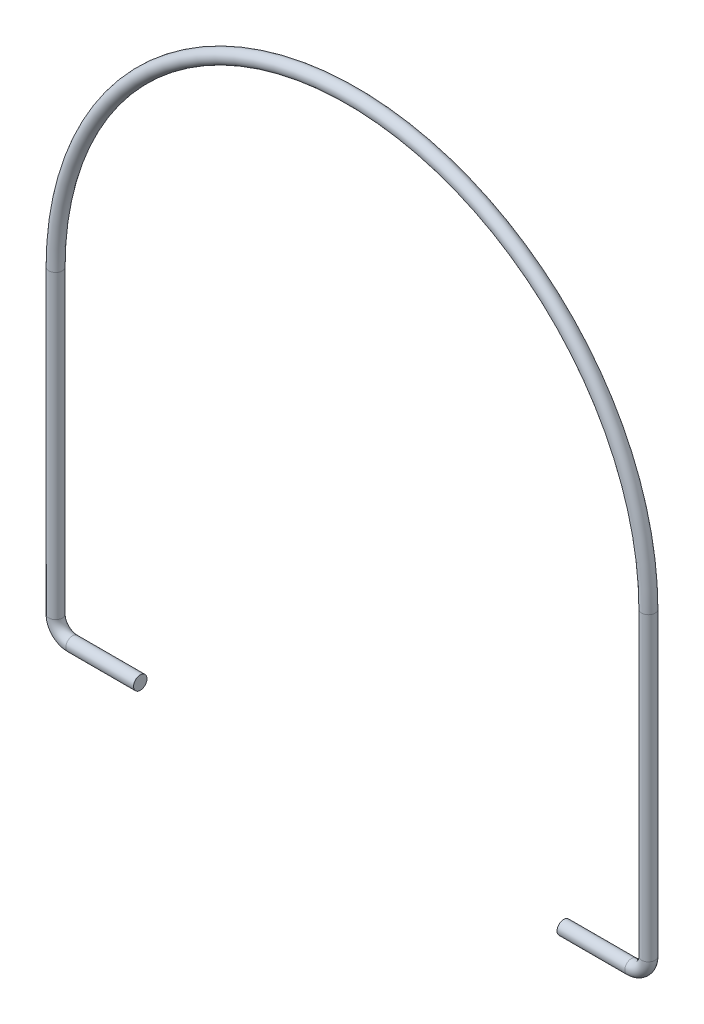
ISO-10303-21;
HEADER;
FILE_DESCRIPTION(('STEP AP214'),'2;1');
FILE_NAME('part.step','',(''),(''),'','','');
FILE_SCHEMA(('AUTOMOTIVE_DESIGN { 1 0 10303 214 1 1 1 1 }'));
ENDSEC;
DATA;
#1=APPLICATION_CONTEXT('core data for automotive mechanical design processes');
#2=APPLICATION_PROTOCOL_DEFINITION('international standard','automotive_design',2000,#1);
#3=PRODUCT_CONTEXT('',#1,'mechanical');
#4=PRODUCT('Part','Part','',(#3));
#5=PRODUCT_RELATED_PRODUCT_CATEGORY('part','',(#4));
#6=PRODUCT_DEFINITION_FORMATION('','',#4);
#7=PRODUCT_DEFINITION_CONTEXT('part definition',#1,'design');
#8=PRODUCT_DEFINITION('design','',#6,#7);
#9=PRODUCT_DEFINITION_SHAPE('','',#8);
#10=(LENGTH_UNIT() NAMED_UNIT(*) SI_UNIT(.MILLI.,.METRE.));
#11=(NAMED_UNIT(*) PLANE_ANGLE_UNIT() SI_UNIT($,.RADIAN.));
#12=(NAMED_UNIT(*) SI_UNIT($,.STERADIAN.) SOLID_ANGLE_UNIT());
#13=UNCERTAINTY_MEASURE_WITH_UNIT(LENGTH_MEASURE(1.E-05),#10,'distance_accuracy_value','');
#14=(GEOMETRIC_REPRESENTATION_CONTEXT(3) GLOBAL_UNCERTAINTY_ASSIGNED_CONTEXT((#13)) GLOBAL_UNIT_ASSIGNED_CONTEXT((#10,
#11,#12)) REPRESENTATION_CONTEXT('',''));
#15=CARTESIAN_POINT('',(0.,0.,0.));
#16=DIRECTION('',(0.,0.,1.));
#17=DIRECTION('',(1.,0.,0.));
#18=AXIS2_PLACEMENT_3D('',#15,#16,#17);
#19=CARTESIAN_POINT('',(116.,0.,0.));
#20=DIRECTION('',(-1.,0.,0.));
#21=DIRECTION('',(0.,-1.,0.));
#22=AXIS2_PLACEMENT_3D('',#19,#20,#21);
#23=CYLINDRICAL_SURFACE('',#22,1.5875);
#24=CARTESIAN_POINT('',(116.,0.,0.));
#25=DIRECTION('',(1.,0.,0.));
#26=DIRECTION('',(0.,0.,-1.));
#27=AXIS2_PLACEMENT_3D('',#24,#25,#26);
#28=CIRCLE('',#27,1.5875);
#29=CARTESIAN_POINT('',(116.,-1.58749999999999,0.));
#30=VERTEX_POINT('',#29);
#31=EDGE_CURVE('E37',#30,#30,#28,.T.);
#32=ORIENTED_EDGE('',*,*,#31,.F.);
#33=EDGE_LOOP('',(#32));
#34=FACE_BOUND('',#33,.T.);
#35=CARTESIAN_POINT('',(100.,0.,0.));
#36=DIRECTION('',(1.,0.,0.));
#37=DIRECTION('',(0.,0.,-1.));
#38=AXIS2_PLACEMENT_3D('',#35,#36,#37);
#39=CIRCLE('',#38,1.5875);
#40=CARTESIAN_POINT('',(100.,0.,-1.5875));
#41=VERTEX_POINT('',#40);
#42=EDGE_CURVE('E10',#41,#41,#39,.T.);
#43=ORIENTED_EDGE('',*,*,#42,.T.);
#44=EDGE_LOOP('',(#43));
#45=FACE_BOUND('',#44,.T.);
#46=ADVANCED_FACE('F31',(#34,#45),#23,.T.);
#47=CARTESIAN_POINT('',(116.,4.,0.));
#48=DIRECTION('',(0.,0.,-1.));
#49=DIRECTION('',(-1.,0.,0.));
#50=AXIS2_PLACEMENT_3D('',#47,#48,#49);
#51=TOROIDAL_SURFACE('',#50,3.99999999999999,1.5875);
#52=CARTESIAN_POINT('',(120.,4.,0.));
#53=DIRECTION('',(0.,1.,0.));
#54=DIRECTION('',(0.,0.,-1.));
#55=AXIS2_PLACEMENT_3D('',#52,#53,#54);
#56=CIRCLE('',#55,1.5875);
#57=CARTESIAN_POINT('',(121.5875,4.,0.));
#58=VERTEX_POINT('',#57);
#59=EDGE_CURVE('E41',#58,#58,#56,.T.);
#60=CARTESIAN_POINT('',(116.,4.,0.));
#61=DIRECTION('',(0.,0.,-1.));
#62=DIRECTION('',(-1.,0.,0.));
#63=AXIS2_PLACEMENT_3D('',#60,#61,#62);
#64=CIRCLE('',#63,5.58749999999999);
#65=EDGE_CURVE('',#58,#30,#64,.T.);
#66=ORIENTED_EDGE('',*,*,#59,.F.);
#67=ORIENTED_EDGE('',*,*,#31,.T.);
#68=ORIENTED_EDGE('',*,*,#65,.T.);
#69=ORIENTED_EDGE('',*,*,#65,.F.);
#70=EDGE_LOOP('',(#66,#68,#67,#69));
#71=FACE_BOUND('',#70,.T.);
#72=ADVANCED_FACE('F87',(#71),#51,.T.);
#73=CARTESIAN_POINT('',(120.,75.,0.));
#74=DIRECTION('',(0.,-1.,0.));
#75=DIRECTION('',(1.,0.,0.));
#76=AXIS2_PLACEMENT_3D('',#73,#74,#75);
#77=CYLINDRICAL_SURFACE('',#76,1.5875);
#78=CARTESIAN_POINT('',(120.,75.,0.));
#79=DIRECTION('',(0.,1.,0.));
#80=DIRECTION('',(0.,0.,-1.));
#81=AXIS2_PLACEMENT_3D('',#78,#79,#80);
#82=CIRCLE('',#81,1.5875);
#83=CARTESIAN_POINT('',(121.5875,75.,0.));
#84=VERTEX_POINT('',#83);
#85=EDGE_CURVE('E45',#84,#84,#82,.T.);
#86=ORIENTED_EDGE('',*,*,#85,.F.);
#87=EDGE_LOOP('',(#86));
#88=FACE_BOUND('',#87,.T.);
#89=ORIENTED_EDGE('',*,*,#59,.T.);
#90=EDGE_LOOP('',(#89));
#91=FACE_BOUND('',#90,.T.);
#92=ADVANCED_FACE('F81',(#88,#91),#77,.T.);
#93=CARTESIAN_POINT('',(50.,75.,0.));
#94=DIRECTION('',(0.,0.,-1.));
#95=DIRECTION('',(-1.,0.,0.));
#96=AXIS2_PLACEMENT_3D('',#93,#94,#95);
#97=TOROIDAL_SURFACE('',#96,70.,1.5875);
#98=CARTESIAN_POINT('',(-20.,75.,0.));
#99=DIRECTION('',(0.,-1.,0.));
#100=DIRECTION('',(0.,0.,-1.));
#101=AXIS2_PLACEMENT_3D('',#98,#99,#100);
#102=CIRCLE('',#101,1.5875);
#103=CARTESIAN_POINT('',(-21.5875,75.,0.));
#104=VERTEX_POINT('',#103);
#105=EDGE_CURVE('E50',#104,#104,#102,.T.);
#106=CARTESIAN_POINT('',(50.,75.,0.));
#107=DIRECTION('',(0.,0.,-1.));
#108=DIRECTION('',(-1.,0.,0.));
#109=AXIS2_PLACEMENT_3D('',#106,#107,#108);
#110=CIRCLE('',#109,71.5875);
#111=EDGE_CURVE('',#104,#84,#110,.T.);
#112=ORIENTED_EDGE('',*,*,#105,.F.);
#113=ORIENTED_EDGE('',*,*,#85,.T.);
#114=ORIENTED_EDGE('',*,*,#111,.T.);
#115=ORIENTED_EDGE('',*,*,#111,.F.);
#116=EDGE_LOOP('',(#112,#114,#113,#115));
#117=FACE_BOUND('',#116,.T.);
#118=ADVANCED_FACE('F75',(#117),#97,.T.);
#119=CARTESIAN_POINT('',(-20.,4.,0.));
#120=DIRECTION('',(0.,1.,0.));
#121=DIRECTION('',(-1.,0.,0.));
#122=AXIS2_PLACEMENT_3D('',#119,#120,#121);
#123=CYLINDRICAL_SURFACE('',#122,1.5875);
#124=CARTESIAN_POINT('',(-20.,4.,0.));
#125=DIRECTION('',(0.,-1.,0.));
#126=DIRECTION('',(0.,0.,-1.));
#127=AXIS2_PLACEMENT_3D('',#124,#125,#126);
#128=CIRCLE('',#127,1.5875);
#129=CARTESIAN_POINT('',(-21.5875,4.,0.));
#130=VERTEX_POINT('',#129);
#131=EDGE_CURVE('E53',#130,#130,#128,.T.);
#132=ORIENTED_EDGE('',*,*,#131,.F.);
#133=EDGE_LOOP('',(#132));
#134=FACE_BOUND('',#133,.T.);
#135=ORIENTED_EDGE('',*,*,#105,.T.);
#136=EDGE_LOOP('',(#135));
#137=FACE_BOUND('',#136,.T.);
#138=ADVANCED_FACE('F69',(#134,#137),#123,.T.);
#139=CARTESIAN_POINT('',(-16.,4.,0.));
#140=DIRECTION('',(0.,0.,-1.));
#141=DIRECTION('',(-1.,0.,0.));
#142=AXIS2_PLACEMENT_3D('',#139,#140,#141);
#143=TOROIDAL_SURFACE('',#142,4.,1.5875);
#144=CARTESIAN_POINT('',(-16.,0.,0.));
#145=DIRECTION('',(1.,0.,0.));
#146=DIRECTION('',(0.,0.,-1.));
#147=AXIS2_PLACEMENT_3D('',#144,#145,#146);
#148=CIRCLE('',#147,1.5875);
#149=CARTESIAN_POINT('',(-16.,-1.5875,0.));
#150=VERTEX_POINT('',#149);
#151=EDGE_CURVE('E56',#150,#150,#148,.T.);
#152=CARTESIAN_POINT('',(-16.,4.,0.));
#153=DIRECTION('',(0.,0.,-1.));
#154=DIRECTION('',(-1.,0.,0.));
#155=AXIS2_PLACEMENT_3D('',#152,#153,#154);
#156=CIRCLE('',#155,5.5875);
#157=EDGE_CURVE('',#150,#130,#156,.T.);
#158=ORIENTED_EDGE('',*,*,#151,.F.);
#159=ORIENTED_EDGE('',*,*,#131,.T.);
#160=ORIENTED_EDGE('',*,*,#157,.T.);
#161=ORIENTED_EDGE('',*,*,#157,.F.);
#162=EDGE_LOOP('',(#158,#160,#159,#161));
#163=FACE_BOUND('',#162,.T.);
#164=ADVANCED_FACE('F66',(#163),#143,.T.);
#165=CARTESIAN_POINT('',(-16.,0.,0.));
#166=DIRECTION('',(1.,0.,0.));
#167=DIRECTION('',(0.,1.,0.));
#168=AXIS2_PLACEMENT_3D('',#165,#166,#167);
#169=CYLINDRICAL_SURFACE('',#168,1.5875);
#170=ORIENTED_EDGE('',*,*,#151,.T.);
#171=EDGE_LOOP('',(#170));
#172=FACE_BOUND('',#171,.T.);
#173=CARTESIAN_POINT('',(0.,0.,0.));
#174=DIRECTION('',(1.,0.,0.));
#175=DIRECTION('',(0.,0.,-1.));
#176=AXIS2_PLACEMENT_3D('',#173,#174,#175);
#177=CIRCLE('',#176,1.5875);
#178=CARTESIAN_POINT('',(0.,0.,-1.5875));
#179=VERTEX_POINT('',#178);
#180=EDGE_CURVE('E57',#179,#179,#177,.T.);
#181=ORIENTED_EDGE('',*,*,#180,.F.);
#182=EDGE_LOOP('',(#181));
#183=FACE_BOUND('',#182,.T.);
#184=ADVANCED_FACE('F63',(#172,#183),#169,.T.);
#185=CARTESIAN_POINT('',(100.,0.,0.));
#186=DIRECTION('',(1.,0.,0.));
#187=DIRECTION('',(0.,0.,-1.));
#188=AXIS2_PLACEMENT_3D('',#185,#186,#187);
#189=PLANE('',#188);
#190=ORIENTED_EDGE('',*,*,#42,.F.);
#191=EDGE_LOOP('',(#190));
#192=FACE_BOUND('',#191,.T.);
#193=ADVANCED_FACE('F99',(#192),#189,.F.);
#194=CARTESIAN_POINT('',(0.,0.,0.));
#195=DIRECTION('',(1.,0.,0.));
#196=DIRECTION('',(0.,0.,-1.));
#197=AXIS2_PLACEMENT_3D('',#194,#195,#196);
#198=PLANE('',#197);
#199=ORIENTED_EDGE('',*,*,#180,.T.);
#200=EDGE_LOOP('',(#199));
#201=FACE_BOUND('',#200,.T.);
#202=ADVANCED_FACE('F100',(#201),#198,.T.);
#203=CLOSED_SHELL('',(#46,#72,#92,#118,#138,#164,#184,#193,#202));
#204=MANIFOLD_SOLID_BREP('B2',#203);
#205=ADVANCED_BREP_SHAPE_REPRESENTATION('',(#18,#204),#14);
#206=SHAPE_DEFINITION_REPRESENTATION(#9,#205);
ENDSEC;
END-ISO-10303-21;
